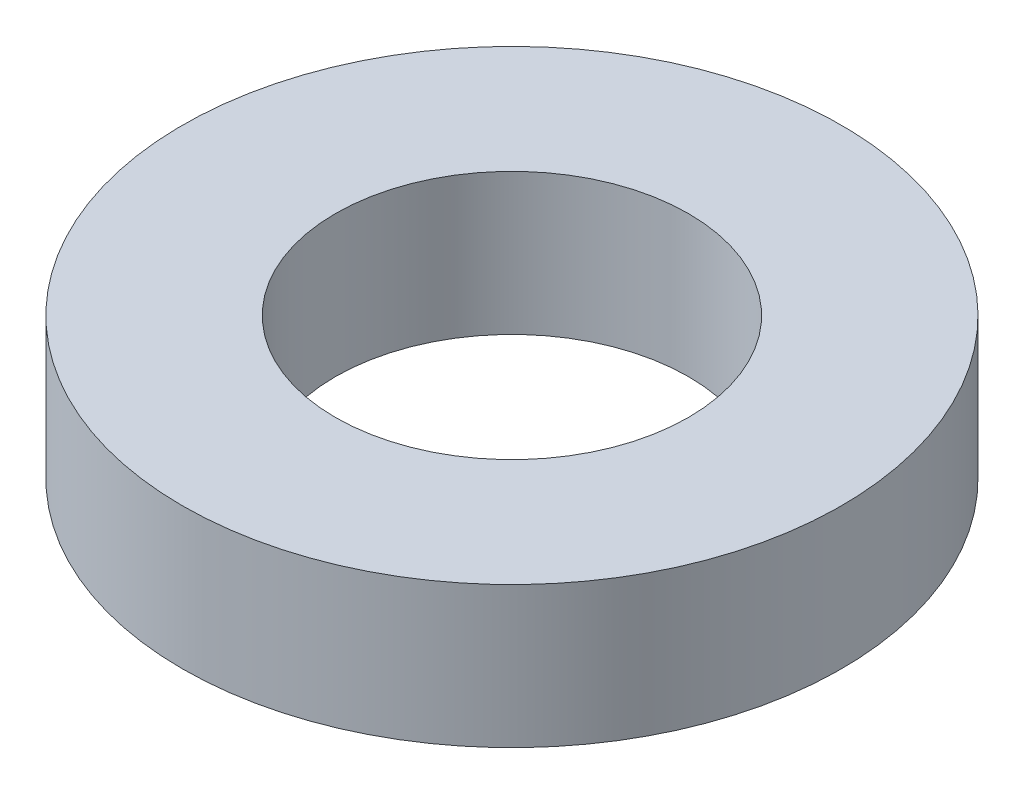
ISO-10303-21;
HEADER;
FILE_DESCRIPTION(('STEP AP214'),'2;1');
FILE_NAME('part.step','',(''),(''),'','','');
FILE_SCHEMA(('AUTOMOTIVE_DESIGN { 1 0 10303 214 1 1 1 1 }'));
ENDSEC;
DATA;
#1=APPLICATION_CONTEXT('core data for automotive mechanical design processes');
#2=APPLICATION_PROTOCOL_DEFINITION('international standard','automotive_design',2000,#1);
#3=PRODUCT_CONTEXT('',#1,'mechanical');
#4=PRODUCT('Part','Part','',(#3));
#5=PRODUCT_RELATED_PRODUCT_CATEGORY('part','',(#4));
#6=PRODUCT_DEFINITION_FORMATION('','',#4);
#7=PRODUCT_DEFINITION_CONTEXT('part definition',#1,'design');
#8=PRODUCT_DEFINITION('design','',#6,#7);
#9=PRODUCT_DEFINITION_SHAPE('','',#8);
#10=(LENGTH_UNIT() NAMED_UNIT(*) SI_UNIT(.MILLI.,.METRE.));
#11=(NAMED_UNIT(*) PLANE_ANGLE_UNIT() SI_UNIT($,.RADIAN.));
#12=(NAMED_UNIT(*) SI_UNIT($,.STERADIAN.) SOLID_ANGLE_UNIT());
#13=UNCERTAINTY_MEASURE_WITH_UNIT(LENGTH_MEASURE(1.E-05),#10,'distance_accuracy_value','');
#14=(GEOMETRIC_REPRESENTATION_CONTEXT(3) GLOBAL_UNCERTAINTY_ASSIGNED_CONTEXT((#13)) GLOBAL_UNIT_ASSIGNED_CONTEXT((#10,
#11,#12)) REPRESENTATION_CONTEXT('',''));
#15=CARTESIAN_POINT('',(0.,0.,0.));
#16=DIRECTION('',(0.,0.,1.));
#17=DIRECTION('',(1.,0.,0.));
#18=AXIS2_PLACEMENT_3D('',#15,#16,#17);
#19=CARTESIAN_POINT('',(0.,30.,0.));
#20=DIRECTION('',(0.,-1.,0.));
#21=DIRECTION('',(0.,0.,-1.));
#22=AXIS2_PLACEMENT_3D('',#19,#20,#21);
#23=CYLINDRICAL_SURFACE('',#22,70.);
#24=CARTESIAN_POINT('',(0.,30.,0.));
#25=DIRECTION('',(0.,1.,0.));
#26=DIRECTION('',(0.,0.,1.));
#27=AXIS2_PLACEMENT_3D('',#24,#25,#26);
#28=CIRCLE('',#27,70.);
#29=CARTESIAN_POINT('',(0.,30.,70.));
#30=VERTEX_POINT('',#29);
#31=EDGE_CURVE('E10',#30,#30,#28,.T.);
#32=ORIENTED_EDGE('',*,*,#31,.F.);
#33=EDGE_LOOP('',(#32));
#34=FACE_BOUND('',#33,.T.);
#35=CARTESIAN_POINT('',(0.,0.,0.));
#36=DIRECTION('',(0.,1.,0.));
#37=DIRECTION('',(0.,0.,1.));
#38=AXIS2_PLACEMENT_3D('',#35,#36,#37);
#39=CIRCLE('',#38,70.);
#40=CARTESIAN_POINT('',(0.,0.,70.));
#41=VERTEX_POINT('',#40);
#42=EDGE_CURVE('E37',#41,#41,#39,.T.);
#43=ORIENTED_EDGE('',*,*,#42,.T.);
#44=EDGE_LOOP('',(#43));
#45=FACE_BOUND('',#44,.T.);
#46=ADVANCED_FACE('F40',(#34,#45),#23,.T.);
#47=CARTESIAN_POINT('',(0.,30.,0.));
#48=DIRECTION('',(0.,1.,0.));
#49=DIRECTION('',(0.,0.,1.));
#50=AXIS2_PLACEMENT_3D('',#47,#48,#49);
#51=PLANE('',#50);
#52=CARTESIAN_POINT('',(0.,30.,0.));
#53=DIRECTION('',(0.,1.,0.));
#54=DIRECTION('',(0.,0.,1.));
#55=AXIS2_PLACEMENT_3D('',#52,#53,#54);
#56=CIRCLE('',#55,37.5);
#57=CARTESIAN_POINT('',(0.,30.,37.5));
#58=VERTEX_POINT('',#57);
#59=EDGE_CURVE('E50',#58,#58,#56,.T.);
#60=ORIENTED_EDGE('',*,*,#59,.F.);
#61=EDGE_LOOP('',(#60));
#62=FACE_BOUND('',#61,.T.);
#63=ORIENTED_EDGE('',*,*,#31,.T.);
#64=EDGE_LOOP('',(#63));
#65=FACE_BOUND('',#64,.T.);
#66=ADVANCED_FACE('F59',(#62,#65),#51,.T.);
#67=CARTESIAN_POINT('',(0.,0.,0.));
#68=DIRECTION('',(0.,1.,0.));
#69=DIRECTION('',(0.,0.,1.));
#70=AXIS2_PLACEMENT_3D('',#67,#68,#69);
#71=PLANE('',#70);
#72=CARTESIAN_POINT('',(0.,0.,0.));
#73=DIRECTION('',(0.,1.,0.));
#74=DIRECTION('',(0.,0.,1.));
#75=AXIS2_PLACEMENT_3D('',#72,#73,#74);
#76=CIRCLE('',#75,37.5);
#77=CARTESIAN_POINT('',(0.,0.,37.5));
#78=VERTEX_POINT('',#77);
#79=EDGE_CURVE('E47',#78,#78,#76,.T.);
#80=ORIENTED_EDGE('',*,*,#79,.T.);
#81=EDGE_LOOP('',(#80));
#82=FACE_BOUND('',#81,.T.);
#83=ORIENTED_EDGE('',*,*,#42,.F.);
#84=EDGE_LOOP('',(#83));
#85=FACE_BOUND('',#84,.T.);
#86=ADVANCED_FACE('F58',(#82,#85),#71,.F.);
#87=CARTESIAN_POINT('',(0.,30.,0.));
#88=DIRECTION('',(0.,-1.,0.));
#89=DIRECTION('',(0.,0.,-1.));
#90=AXIS2_PLACEMENT_3D('',#87,#88,#89);
#91=CYLINDRICAL_SURFACE('',#90,37.5);
#92=ORIENTED_EDGE('',*,*,#59,.T.);
#93=EDGE_LOOP('',(#92));
#94=FACE_BOUND('',#93,.T.);
#95=ORIENTED_EDGE('',*,*,#79,.F.);
#96=EDGE_LOOP('',(#95));
#97=FACE_BOUND('',#96,.T.);
#98=ADVANCED_FACE('F54',(#94,#97),#91,.F.);
#99=CLOSED_SHELL('',(#46,#66,#86,#98));
#100=MANIFOLD_SOLID_BREP('B2',#99);
#101=ADVANCED_BREP_SHAPE_REPRESENTATION('',(#18,#100),#14);
#102=SHAPE_DEFINITION_REPRESENTATION(#9,#101);
ENDSEC;
END-ISO-10303-21;
